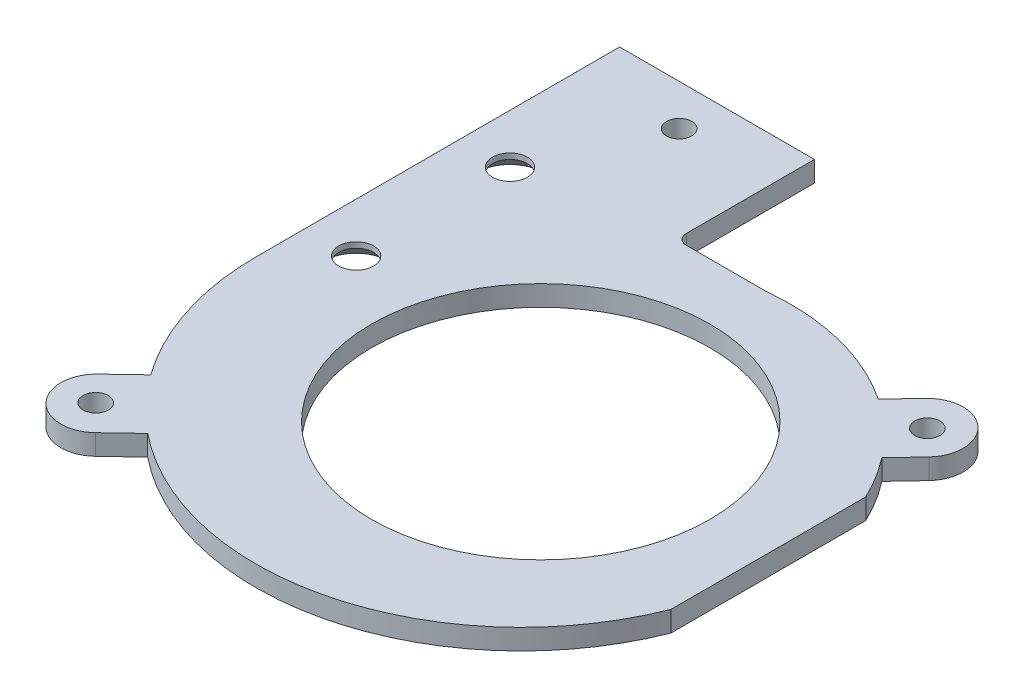
ISO-10303-21;
HEADER;
FILE_DESCRIPTION(('STEP AP214'),'2;1');
FILE_NAME('part.step','',(''),(''),'','','');
FILE_SCHEMA(('AUTOMOTIVE_DESIGN { 1 0 10303 214 1 1 1 1 }'));
ENDSEC;
DATA;
#1=APPLICATION_CONTEXT('core data for automotive mechanical design processes');
#2=APPLICATION_PROTOCOL_DEFINITION('international standard','automotive_design',2000,#1);
#3=PRODUCT_CONTEXT('',#1,'mechanical');
#4=PRODUCT('Part','Part','',(#3));
#5=PRODUCT_RELATED_PRODUCT_CATEGORY('part','',(#4));
#6=PRODUCT_DEFINITION_FORMATION('','',#4);
#7=PRODUCT_DEFINITION_CONTEXT('part definition',#1,'design');
#8=PRODUCT_DEFINITION('design','',#6,#7);
#9=PRODUCT_DEFINITION_SHAPE('','',#8);
#10=(LENGTH_UNIT() NAMED_UNIT(*) SI_UNIT(.MILLI.,.METRE.));
#11=(NAMED_UNIT(*) PLANE_ANGLE_UNIT() SI_UNIT($,.RADIAN.));
#12=(NAMED_UNIT(*) SI_UNIT($,.STERADIAN.) SOLID_ANGLE_UNIT());
#13=UNCERTAINTY_MEASURE_WITH_UNIT(LENGTH_MEASURE(1.E-05),#10,'distance_accuracy_value','');
#14=(GEOMETRIC_REPRESENTATION_CONTEXT(3) GLOBAL_UNCERTAINTY_ASSIGNED_CONTEXT((#13)) GLOBAL_UNIT_ASSIGNED_CONTEXT((#10,
#11,#12)) REPRESENTATION_CONTEXT('',''));
#15=CARTESIAN_POINT('',(0.,0.,0.));
#16=DIRECTION('',(0.,0.,1.));
#17=DIRECTION('',(1.,0.,0.));
#18=AXIS2_PLACEMENT_3D('',#15,#16,#17);
#19=CARTESIAN_POINT('',(8.978565370932,-34.81359238585,151.37999999223));
#20=DIRECTION('',(3.85373208206454E-09,0.999999999999881,4.88111568497342E-07));
#21=DIRECTION('',(0.,-4.88111568497342E-07,0.999999999999881));
#22=AXIS2_PLACEMENT_3D('',#19,#20,#21);
#23=CYLINDRICAL_SURFACE('',#22,1.);
#24=CARTESIAN_POINT('',(8.97856536322453,-36.8135923858537,151.379999016007));
#25=DIRECTION('',(3.85373208206454E-09,0.999999999999881,4.88111568497342E-07));
#26=DIRECTION('',(0.,-4.88111568497342E-07,0.999999999999881));
#27=AXIS2_PLACEMENT_3D('',#24,#25,#26);
#28=CIRCLE('',#27,1.);
#29=CARTESIAN_POINT('',(8.97856536758903,-36.8135928739677,152.379999016007));
#30=VERTEX_POINT('',#29);
#31=CARTESIAN_POINT('',(7.97856536322454,-36.8135923820001,151.379999504628));
#32=VERTEX_POINT('',#31);
#33=EDGE_CURVE('E139',#30,#32,#28,.F.);
#34=ORIENTED_EDGE('',*,*,#33,.T.);
#35=DIRECTION('',(3.853731832869E-09,1.,0.));
#36=VECTOR('',#35,1.);
#37=CARTESIAN_POINT('',(7.978565370932,-34.813592382,151.37999999274));
#38=LINE('',#37,#36);
#39=CARTESIAN_POINT('',(7.97856537093249,-34.8135923820047,151.379999992485));
#40=VERTEX_POINT('',#39);
#41=EDGE_CURVE('E137',#40,#32,#38,.F.);
#42=ORIENTED_EDGE('',*,*,#41,.F.);
#43=CARTESIAN_POINT('',(8.978565370932,-34.8135923858584,151.37999999223));
#44=DIRECTION('',(3.85373208206454E-09,0.999999999999881,4.88111568497342E-07));
#45=DIRECTION('',(0.,-4.88111568497342E-07,0.999999999999881));
#46=AXIS2_PLACEMENT_3D('',#43,#44,#45);
#47=CIRCLE('',#46,1.);
#48=CARTESIAN_POINT('',(8.978565370932,-34.81359287397,152.37999999024));
#49=VERTEX_POINT('',#48);
#50=EDGE_CURVE('E19',#49,#40,#47,.F.);
#51=ORIENTED_EDGE('',*,*,#50,.F.);
#52=DIRECTION('',(0.,-0.999999999999881,-4.88111568497342E-07));
#53=VECTOR('',#52,1.);
#54=CARTESIAN_POINT('',(8.978565371443,-34.81359287397,152.37999999223));
#55=LINE('',#54,#53);
#56=EDGE_CURVE('E205',#49,#30,#55,.T.);
#57=ORIENTED_EDGE('',*,*,#56,.T.);
#58=EDGE_LOOP('',(#34,#42,#51,#57));
#59=FACE_BOUND('',#58,.T.);
#60=ADVANCED_FACE('F16',(#59),#23,.F.);
#61=CARTESIAN_POINT('',(-6.21660882999991,-36.8135937916034,154.379999023768));
#62=DIRECTION('',(-3.85373305832955E-09,-0.999999999999881,-4.88111568368455E-07));
#63=DIRECTION('',(0.,4.88111568368455E-07,-0.999999999999881));
#64=AXIS2_PLACEMENT_3D('',#61,#62,#63);
#65=CONICAL_SURFACE('',#64,3.1499999999322,0.78539816340929);
#66=CARTESIAN_POINT('',(-6.21660882999991,-36.8135937916762,154.379999023768));
#67=DIRECTION('',(-3.85373305832955E-09,-0.999999999999881,-4.88111568368455E-07));
#68=DIRECTION('',(0.,4.88111568368455E-07,-0.999999999999881));
#69=AXIS2_PLACEMENT_3D('',#66,#67,#68);
#70=CIRCLE('',#69,3.15000000000509);
#71=CARTESIAN_POINT('',(-6.21660882999991,-36.8135922541248,151.229999023763));
#72=VERTEX_POINT('',#71);
#73=EDGE_CURVE('E135',#72,#72,#70,.T.);
#74=ORIENTED_EDGE('',*,*,#73,.T.);
#75=EDGE_LOOP('',(#74));
#76=FACE_BOUND('',#75,.T.);
#77=CARTESIAN_POINT('',(-6.21660882441209,-35.3635937916287,154.379999731532));
#78=DIRECTION('',(-3.85373208206454E-09,-0.999999999999881,-4.88111568497342E-07));
#79=DIRECTION('',(0.,4.88111568497342E-07,-0.999999999999881));
#80=AXIS2_PLACEMENT_3D('',#77,#78,#79);
#81=CIRCLE('',#80,1.7);
#82=CARTESIAN_POINT('',(-6.21660882441209,-35.363592961839,152.679999731532));
#83=VERTEX_POINT('',#82);
#84=EDGE_CURVE('E185',#83,#83,#81,.F.);
#85=ORIENTED_EDGE('',*,*,#84,.T.);
#86=EDGE_LOOP('',(#85));
#87=FACE_BOUND('',#86,.T.);
#88=ADVANCED_FACE('F231',(#76,#87),#65,.F.);
#89=CARTESIAN_POINT('',(-6.21660882234191,-36.8136011131494,169.379999023768));
#90=DIRECTION('',(-3.85373195697229E-09,-0.999999999999881,-4.88111568374805E-07));
#91=DIRECTION('',(0.,4.88111568374805E-07,-0.999999999999881));
#92=AXIS2_PLACEMENT_3D('',#89,#90,#91);
#93=CONICAL_SURFACE('',#92,3.14999999989122,0.78539816340929);
#94=CARTESIAN_POINT('',(-6.21660882234191,-36.8136011132064,169.379999023768));
#95=DIRECTION('',(-3.85373195697229E-09,-0.999999999999881,-4.88111568374805E-07));
#96=DIRECTION('',(0.,4.88111568374805E-07,-0.999999999999881));
#97=AXIS2_PLACEMENT_3D('',#94,#95,#96);
#98=CIRCLE('',#97,3.14999999994825);
#99=CARTESIAN_POINT('',(-6.21660882234191,-36.813599575655,166.22999902382));
#100=VERTEX_POINT('',#99);
#101=EDGE_CURVE('E225',#100,#100,#98,.T.);
#102=ORIENTED_EDGE('',*,*,#101,.T.);
#103=EDGE_LOOP('',(#102));
#104=FACE_BOUND('',#103,.T.);
#105=CARTESIAN_POINT('',(-6.21660881675409,-35.3636011133087,169.379999731522));
#106=DIRECTION('',(-3.85373208206454E-09,-0.999999999999881,-4.88111568497342E-07));
#107=DIRECTION('',(0.,4.88111568497342E-07,-0.999999999999881));
#108=AXIS2_PLACEMENT_3D('',#105,#106,#107);
#109=CIRCLE('',#108,1.7);
#110=CARTESIAN_POINT('',(-6.21660881675409,-35.363600283519,167.679999731522));
#111=VERTEX_POINT('',#110);
#112=EDGE_CURVE('E178',#111,#111,#109,.F.);
#113=ORIENTED_EDGE('',*,*,#112,.T.);
#114=EDGE_LOOP('',(#113));
#115=FACE_BOUND('',#114,.T.);
#116=ADVANCED_FACE('F237',(#104,#115),#93,.F.);
#117=CARTESIAN_POINT('',(38.983391185061,-36.81360836511,183.87999900069));
#118=DIRECTION('',(3.85373208206454E-09,0.999999999999881,4.88111568497342E-07));
#119=DIRECTION('',(0.,-4.88111568497342E-07,0.999999999999881));
#120=AXIS2_PLACEMENT_3D('',#117,#118,#119);
#121=PLANE('',#120);
#122=ORIENTED_EDGE('',*,*,#101,.F.);
#123=EDGE_LOOP('',(#122));
#124=FACE_BOUND('',#123,.T.);
#125=CARTESIAN_POINT('',(-1.216608835871,-36.8135881976199,142.87999902121));
#126=DIRECTION('',(-3.85373208206454E-09,-0.999999999999881,-4.88111568497342E-07));
#127=DIRECTION('',(0.,4.88111568497342E-07,-0.999999999999881));
#128=AXIS2_PLACEMENT_3D('',#125,#126,#127);
#129=CIRCLE('',#128,1.23);
#130=CARTESIAN_POINT('',(-1.216608835871,-36.8135875972427,141.64999902121));
#131=VERTEX_POINT('',#130);
#132=EDGE_CURVE('E175',#131,#131,#129,.F.);
#133=ORIENTED_EDGE('',*,*,#132,.T.);
#134=EDGE_LOOP('',(#133));
#135=FACE_BOUND('',#134,.T.);
#136=CARTESIAN_POINT('',(-6.516608809528,-36.8136133637499,194.47999902391));
#137=DIRECTION('',(-3.85373208206454E-09,-0.999999999999881,-4.88111568497342E-07));
#138=DIRECTION('',(0.,4.88111568497342E-07,-0.999999999999881));
#139=AXIS2_PLACEMENT_3D('',#136,#137,#138);
#140=CIRCLE('',#139,1.23);
#141=CARTESIAN_POINT('',(-6.516608809528,-36.8136127633727,193.24999902391));
#142=VERTEX_POINT('',#141);
#143=EDGE_CURVE('E179',#142,#142,#140,.F.);
#144=ORIENTED_EDGE('',*,*,#143,.T.);
#145=EDGE_LOOP('',(#144));
#146=FACE_BOUND('',#145,.T.);
#147=CARTESIAN_POINT('',(36.183391170868,-36.8135947848199,156.07999900212));
#148=DIRECTION('',(-3.85373208206454E-09,-0.999999999999881,-4.88111568497342E-07));
#149=DIRECTION('',(0.,4.88111568497342E-07,-0.999999999999881));
#150=AXIS2_PLACEMENT_3D('',#147,#148,#149);
#151=CIRCLE('',#150,1.23);
#152=CARTESIAN_POINT('',(36.183391170868,-36.8135941844427,154.84999900212));
#153=VERTEX_POINT('',#152);
#154=EDGE_CURVE('E182',#153,#153,#151,.F.);
#155=ORIENTED_EDGE('',*,*,#154,.T.);
#156=EDGE_LOOP('',(#155));
#157=FACE_BOUND('',#156,.T.);
#158=CARTESIAN_POINT('',(16.783391180211,-36.8136036424934,174.37999901202));
#159=DIRECTION('',(-3.85373208206454E-09,-0.999999999999881,-4.88111568497342E-07));
#160=DIRECTION('',(0.,4.88111568497342E-07,-0.999999999999881));
#161=AXIS2_PLACEMENT_3D('',#158,#159,#160);
#162=CIRCLE('',#161,16.5);
#163=CARTESIAN_POINT('',(16.783391180211,-36.8135955886525,157.879999012022));
#164=VERTEX_POINT('',#163);
#165=EDGE_CURVE('E186',#164,#164,#162,.F.);
#166=ORIENTED_EDGE('',*,*,#165,.T.);
#167=EDGE_LOOP('',(#166));
#168=FACE_BOUND('',#167,.T.);
#169=CARTESIAN_POINT('',(-6.41660881899946,-36.8136133641331,194.479999032877));
#170=DIRECTION('',(3.85373208206454E-09,0.999999999999881,4.88111568497342E-07));
#171=DIRECTION('',(0.,-4.88111568497342E-07,0.999999999999881));
#172=AXIS2_PLACEMENT_3D('',#169,#170,#171);
#173=CIRCLE('',#172,3.5);
#174=CARTESIAN_POINT('',(-8.82877273093449,-36.81361211697,191.943965661255));
#175=VERTEX_POINT('',#174);
#176=CARTESIAN_POINT('',(-4.00444513458413,-36.8136146112981,197.016032620899));
#177=VERTEX_POINT('',#176);
#178=EDGE_CURVE('E190',#175,#177,#173,.T.);
#179=ORIENTED_EDGE('',*,*,#178,.F.);
#180=DIRECTION('',(0.724580962032362,0.,-0.689189690477344));
#181=VECTOR('',#180,1.);
#182=CARTESIAN_POINT('',(-8.8287732096511,-36.81361211697,191.943966116587));
#183=LINE('',#182,#181);
#184=CARTESIAN_POINT('',(-6.19489892542695,-36.8136086974114,189.438740202829));
#185=VERTEX_POINT('',#184);
#186=EDGE_CURVE('E196',#175,#185,#183,.T.);
#187=ORIENTED_EDGE('',*,*,#186,.T.);
#188=CARTESIAN_POINT('',(14.8833911802105,-36.8136036351803,174.379999012987));
#189=DIRECTION('',(3.85373208206454E-09,0.999999999999881,4.88111568497342E-07));
#190=DIRECTION('',(0.,-4.88111568497342E-07,0.999999999999881));
#191=AXIS2_PLACEMENT_3D('',#188,#189,#190);
#192=CIRCLE('',#191,25.904825805243);
#193=CARTESIAN_POINT('',(-11.02143462503,-36.81360353535,174.379999026214));
#194=VERTEX_POINT('',#193);
#195=EDGE_CURVE('E193',#194,#185,#192,.T.);
#196=ORIENTED_EDGE('',*,*,#195,.F.);
#197=DIRECTION('',(-5.10530194019814E-10,4.88111549223218E-07,-0.999999999999881));
#198=VECTOR('',#197,1.);
#199=CARTESIAN_POINT('',(-11.0214346250275,-36.81360353535,174.37999902622));
#200=LINE('',#199,#198);
#201=CARTESIAN_POINT('',(-11.0214346431513,-36.81358620739,138.879999026219));
#202=VERTEX_POINT('',#201);
#203=EDGE_CURVE('E199',#194,#202,#200,.T.);
#204=ORIENTED_EDGE('',*,*,#203,.T.);
#205=DIRECTION('',(1.,0.,-5.10530155490978E-10));
#206=VECTOR('',#205,1.);
#207=CARTESIAN_POINT('',(-11.02143463544,-36.81358620739,138.879999026217));
#208=LINE('',#207,#206);
#209=CARTESIAN_POINT('',(7.97856535684291,-36.8135862439976,138.879999016519));
#210=VERTEX_POINT('',#209);
#211=EDGE_CURVE('E200',#202,#210,#208,.T.);
#212=ORIENTED_EDGE('',*,*,#211,.T.);
#213=DIRECTION('',(-5.1053015549115E-10,4.88111568499309E-07,-0.999999999999881));
#214=VECTOR('',#213,1.);
#215=CARTESIAN_POINT('',(7.97856537981676,-36.8136082456257,183.879999016519));
#216=LINE('',#215,#214);
#217=EDGE_CURVE('E143',#32,#210,#216,.T.);
#218=ORIENTED_EDGE('',*,*,#217,.F.);
#219=ORIENTED_EDGE('',*,*,#33,.F.);
#220=DIRECTION('',(1.,0.,-5.10530155490978E-10));
#221=VECTOR('',#220,1.);
#222=CARTESIAN_POINT('',(8.978565371443,-36.81359287397,152.379999016007));
#223=LINE('',#222,#221);
#224=CARTESIAN_POINT('',(16.7833911689793,-36.813592889007,152.379999012025));
#225=VERTEX_POINT('',#224);
#226=EDGE_CURVE('E369',#30,#225,#223,.T.);
#227=ORIENTED_EDGE('',*,*,#226,.T.);
#228=CARTESIAN_POINT('',(19.0151479369675,-36.8136036510992,174.379999010887));
#229=DIRECTION('',(3.85373208206454E-09,0.999999999999881,4.88111568497342E-07));
#230=DIRECTION('',(0.,-4.88111568497342E-07,0.999999999999881));
#231=AXIS2_PLACEMENT_3D('',#228,#229,#230);
#232=CIRCLE('',#231,22.112908859337);
#233=CARTESIAN_POINT('',(31.3343527833157,-36.8135981961535,156.01650451297));
#234=VERTEX_POINT('',#233);
#235=EDGE_CURVE('E202',#234,#225,#232,.T.);
#236=ORIENTED_EDGE('',*,*,#235,.F.);
#237=DIRECTION('',(0.685818352556089,0.,-0.727772758007094));
#238=VECTOR('',#237,1.);
#239=CARTESIAN_POINT('',(31.3343522996923,-36.81359473514,156.01650502618));
#240=LINE('',#239,#238);
#241=CARTESIAN_POINT('',(33.5833911632443,-36.8135941570032,153.629882955639));
#242=VERTEX_POINT('',#241);
#243=EDGE_CURVE('E210',#234,#242,#240,.T.);
#244=ORIENTED_EDGE('',*,*,#243,.T.);
#245=CARTESIAN_POINT('',(36.1305958098985,-36.8135947603282,156.030247196347));
#246=DIRECTION('',(3.85373208206454E-09,0.999999999999881,4.88111568497342E-07));
#247=DIRECTION('',(0.,-4.88111568497342E-07,0.999999999999881));
#248=AXIS2_PLACEMENT_3D('',#245,#246,#247);
#249=CIRCLE('',#248,3.5);
#250=CARTESIAN_POINT('',(38.6778004692925,-36.813596512665,158.430611423532));
#251=VERTEX_POINT('',#250);
#252=EDGE_CURVE('E207',#251,#242,#249,.T.);
#253=ORIENTED_EDGE('',*,*,#252,.F.);
#254=DIRECTION('',(0.685818352556089,0.,-0.727772758007094));
#255=VECTOR('',#254,1.);
#256=CARTESIAN_POINT('',(36.4570024765123,-36.81359708354,160.78726500995));
#257=LINE('',#256,#255);
#258=CARTESIAN_POINT('',(36.4570027458092,-36.8136005510887,160.787264731924));
#259=VERTEX_POINT('',#258);
#260=EDGE_CURVE('E377',#259,#251,#257,.T.);
#261=ORIENTED_EDGE('',*,*,#260,.F.);
#262=CARTESIAN_POINT('',(19.0151479369675,-36.8136036510977,174.379999010887));
#263=DIRECTION('',(3.85373208206454E-09,0.999999999999881,4.88111568497342E-07));
#264=DIRECTION('',(0.,-4.88111568497342E-07,0.999999999999881));
#265=AXIS2_PLACEMENT_3D('',#262,#263,#264);
#266=CIRCLE('',#265,22.112908859337);
#267=CARTESIAN_POINT('',(38.9833911753594,-36.81359909099,164.87999900069));
#268=VERTEX_POINT('',#267);
#269=EDGE_CURVE('E212',#268,#259,#266,.T.);
#270=ORIENTED_EDGE('',*,*,#269,.F.);
#271=DIRECTION('',(-5.1053015549115E-10,4.88111568499309E-07,-0.999999999999881));
#272=VECTOR('',#271,1.);
#273=CARTESIAN_POINT('',(38.9833911850605,-36.81360836511,183.87999900069));
#274=LINE('',#273,#272);
#275=CARTESIAN_POINT('',(38.9833911850605,-36.8136083651101,183.879999488796));
#276=VERTEX_POINT('',#275);
#277=EDGE_CURVE('E218',#276,#268,#274,.T.);
#278=ORIENTED_EDGE('',*,*,#277,.F.);
#279=CARTESIAN_POINT('',(14.8833911802105,-36.8136036351748,174.379999012987));
#280=DIRECTION('',(3.85373208206454E-09,0.999999999999881,4.88111568497342E-07));
#281=DIRECTION('',(0.,-4.88111568497342E-07,0.999999999999881));
#282=AXIS2_PLACEMENT_3D('',#279,#280,#281);
#283=CIRCLE('',#282,25.904825805243);
#284=CARTESIAN_POINT('',(-1.39342729166376,-36.8136111917382,194.5325467535));
#285=VERTEX_POINT('',#284);
#286=EDGE_CURVE('E223',#285,#276,#283,.T.);
#287=ORIENTED_EDGE('',*,*,#286,.F.);
#288=DIRECTION('',(0.724580962032362,0.,-0.689189690477344));
#289=VECTOR('',#288,1.);
#290=CARTESIAN_POINT('',(-4.0044453763111,-36.8136146113,197.016032850817));
#291=LINE('',#290,#289);
#292=EDGE_CURVE('E349',#177,#285,#291,.T.);
#293=ORIENTED_EDGE('',*,*,#292,.F.);
#294=EDGE_LOOP('',(#179,#187,#196,#204,#212,#218,#219,#227,#236,#244,#253,#261,#270,#278,#287,#293));
#295=FACE_BOUND('',#294,.T.);
#296=ORIENTED_EDGE('',*,*,#73,.F.);
#297=EDGE_LOOP('',(#296));
#298=FACE_BOUND('',#297,.T.);
#299=ADVANCED_FACE('F234',(#124,#135,#146,#157,#168,#295,#298),#121,.F.);
#300=CARTESIAN_POINT('',(14.883391187918,-34.81360363518,174.37999998921));
#301=DIRECTION('',(3.85373208206454E-09,0.999999999999881,4.88111568497342E-07));
#302=DIRECTION('',(0.,-4.88111568497342E-07,0.999999999999881));
#303=AXIS2_PLACEMENT_3D('',#300,#301,#302);
#304=CYLINDRICAL_SURFACE('',#303,25.904825805243);
#305=ORIENTED_EDGE('',*,*,#286,.T.);
#306=DIRECTION('',(3.853731832869E-09,1.,0.));
#307=VECTOR('',#306,1.);
#308=CARTESIAN_POINT('',(38.983391192768,-34.81360836511,183.87999997691));
#309=LINE('',#308,#307);
#310=CARTESIAN_POINT('',(38.983391192768,-34.81360836511,183.879999976907));
#311=VERTEX_POINT('',#310);
#312=EDGE_CURVE('E220',#311,#276,#309,.F.);
#313=ORIENTED_EDGE('',*,*,#312,.F.);
#314=CARTESIAN_POINT('',(14.883391187918,-34.8136036351752,174.37999998921));
#315=DIRECTION('',(3.85373208206454E-09,0.999999999999881,4.88111568497342E-07));
#316=DIRECTION('',(0.,-4.88111568497342E-07,0.999999999999881));
#317=AXIS2_PLACEMENT_3D('',#314,#315,#316);
#318=CIRCLE('',#317,25.904825805243);
#319=CARTESIAN_POINT('',(-1.39342704223063,-34.8136134091402,194.532547499801));
#320=VERTEX_POINT('',#319);
#321=EDGE_CURVE('E172',#320,#311,#318,.T.);
#322=ORIENTED_EDGE('',*,*,#321,.F.);
#323=DIRECTION('',(2.45580549129599E-07,0.999999999999937,2.58191602404143E-07));
#324=VECTOR('',#323,1.);
#325=CARTESIAN_POINT('',(-1.39342680050402,-34.8136146113,194.532547269883));
#326=LINE('',#325,#324);
#327=EDGE_CURVE('E189',#285,#320,#326,.T.);
#328=ORIENTED_EDGE('',*,*,#327,.F.);
#329=EDGE_LOOP('',(#305,#313,#322,#328));
#330=FACE_BOUND('',#329,.T.);
#331=ADVANCED_FACE('F236',(#330),#304,.T.);
#332=CARTESIAN_POINT('',(38.983391192768,-34.81360836511,183.87999997691));
#333=DIRECTION('',(1.,-3.853731832869E-09,-5.105320365423E-10));
#334=DIRECTION('',(3.853731832869E-09,1.,0.));
#335=AXIS2_PLACEMENT_3D('',#332,#333,#334);
#336=PLANE('',#335);
#337=DIRECTION('',(3.85373208206454E-09,0.999999999999881,4.88111568497342E-07));
#338=VECTOR('',#337,1.);
#339=CARTESIAN_POINT('',(38.9833911830659,-34.8135990909924,164.879999976911));
#340=LINE('',#339,#338);
#341=CARTESIAN_POINT('',(38.9833911879169,-34.8135990909871,164.879999987108));
#342=VERTEX_POINT('',#341);
#343=EDGE_CURVE('E215',#342,#268,#340,.F.);
#344=ORIENTED_EDGE('',*,*,#343,.F.);
#345=DIRECTION('',(0.,-4.88111568497342E-07,0.999999999999881));
#346=VECTOR('',#345,1.);
#347=CARTESIAN_POINT('',(38.983391192768,-34.81360836511,183.87999997691));
#348=LINE('',#347,#346);
#349=EDGE_CURVE('E169',#311,#342,#348,.F.);
#350=ORIENTED_EDGE('',*,*,#349,.F.);
#351=ORIENTED_EDGE('',*,*,#312,.T.);
#352=ORIENTED_EDGE('',*,*,#277,.T.);
#353=EDGE_LOOP('',(#344,#350,#351,#352));
#354=FACE_BOUND('',#353,.T.);
#355=ADVANCED_FACE('F245',(#354),#336,.T.);
#356=CARTESIAN_POINT('',(19.015147944675,-34.8136036511,174.37999998711));
#357=DIRECTION('',(3.85373208206454E-09,0.999999999999881,4.88111568497342E-07));
#358=DIRECTION('',(0.,-4.88111568497342E-07,0.999999999999881));
#359=AXIS2_PLACEMENT_3D('',#356,#357,#358);
#360=CYLINDRICAL_SURFACE('',#359,22.112908859337);
#361=ORIENTED_EDGE('',*,*,#269,.T.);
#362=DIRECTION('',(2.45667345536751E-07,0.999999999999943,2.31505194910304E-07));
#363=VECTOR('',#362,1.);
#364=CARTESIAN_POINT('',(36.4570029678465,-34.81359708354,160.787265472961));
#365=LINE('',#364,#363);
#366=CARTESIAN_POINT('',(36.4570029678447,-34.8135970835416,160.787265472962));
#367=VERTEX_POINT('',#366);
#368=EDGE_CURVE('E214',#367,#259,#365,.F.);
#369=ORIENTED_EDGE('',*,*,#368,.F.);
#370=CARTESIAN_POINT('',(19.015147944675,-34.8136036510947,174.37999998711));
#371=DIRECTION('',(3.85373208206454E-09,0.999999999999881,4.88111568497342E-07));
#372=DIRECTION('',(0.,-4.88111568497342E-07,0.999999999999881));
#373=AXIS2_PLACEMENT_3D('',#370,#371,#372);
#374=CIRCLE('',#373,22.112908859337);
#375=EDGE_CURVE('E166',#342,#367,#374,.T.);
#376=ORIENTED_EDGE('',*,*,#375,.F.);
#377=ORIENTED_EDGE('',*,*,#343,.T.);
#378=EDGE_LOOP('',(#361,#369,#376,#377));
#379=FACE_BOUND('',#378,.T.);
#380=ADVANCED_FACE('F327',(#379),#360,.T.);
#381=CARTESIAN_POINT('',(36.457002967847,-34.81359708354,160.78726547296));
#382=DIRECTION('',(0.727772758007053,-3.37560512995124E-07,0.68581835255605));
#383=DIRECTION('',(0.685818352556089,0.,-0.727772758007094));
#384=AXIS2_PLACEMENT_3D('',#381,#382,#383);
#385=PLANE('',#384);
#386=DIRECTION('',(3.85373208206454E-09,0.999999999999881,4.88111568497342E-07));
#387=VECTOR('',#386,1.);
#388=CARTESIAN_POINT('',(38.6778004833707,-34.8135959417918,158.430612392997));
#389=LINE('',#388,#387);
#390=CARTESIAN_POINT('',(38.677800477,-34.8135959417936,158.430612399761));
#391=VERTEX_POINT('',#390);
#392=EDGE_CURVE('E211',#391,#251,#389,.F.);
#393=ORIENTED_EDGE('',*,*,#392,.F.);
#394=DIRECTION('',(0.685818352557551,3.52591341394358E-07,-0.72777275800563));
#395=VECTOR('',#394,1.);
#396=CARTESIAN_POINT('',(36.457002967846,-34.8135970835431,160.78726547296));
#397=LINE('',#396,#395);
#398=EDGE_CURVE('E165',#367,#391,#397,.T.);
#399=ORIENTED_EDGE('',*,*,#398,.F.);
#400=ORIENTED_EDGE('',*,*,#368,.T.);
#401=ORIENTED_EDGE('',*,*,#260,.T.);
#402=EDGE_LOOP('',(#393,#399,#400,#401));
#403=FACE_BOUND('',#402,.T.);
#404=ADVANCED_FACE('F323',(#403),#385,.T.);
#405=CARTESIAN_POINT('',(36.130595817606,-34.81359476033,156.03024817257));
#406=DIRECTION('',(3.85373208206454E-09,0.999999999999881,4.88111568497342E-07));
#407=DIRECTION('',(0.,-4.88111568497342E-07,0.999999999999881));
#408=AXIS2_PLACEMENT_3D('',#405,#406,#407);
#409=CYLINDRICAL_SURFACE('',#408,3.5);
#410=ORIENTED_EDGE('',*,*,#252,.T.);
#411=DIRECTION('',(2.45667345536751E-07,0.999999999999943,2.31505194910304E-07));
#412=VECTOR('',#411,1.);
#413=CARTESIAN_POINT('',(33.5833916609498,-34.81359473514,153.629883411889));
#414=LINE('',#413,#412);
#415=CARTESIAN_POINT('',(33.5833914127651,-34.813593578869,153.629883675256));
#416=VERTEX_POINT('',#415);
#417=EDGE_CURVE('E373',#242,#416,#414,.T.);
#418=ORIENTED_EDGE('',*,*,#417,.T.);
#419=CARTESIAN_POINT('',(36.130595817606,-34.8135947603318,156.03024817257));
#420=DIRECTION('',(3.85373208206454E-09,0.999999999999881,4.88111568497342E-07));
#421=DIRECTION('',(0.,-4.88111568497342E-07,0.999999999999881));
#422=AXIS2_PLACEMENT_3D('',#419,#420,#421);
#423=CIRCLE('',#422,3.5);
#424=EDGE_CURVE('E162',#391,#416,#423,.T.);
#425=ORIENTED_EDGE('',*,*,#424,.F.);
#426=ORIENTED_EDGE('',*,*,#392,.T.);
#427=EDGE_LOOP('',(#410,#418,#425,#426));
#428=FACE_BOUND('',#427,.T.);
#429=ADVANCED_FACE('F319',(#428),#409,.T.);
#430=CARTESIAN_POINT('',(31.334352791027,-34.81359473514,156.01650548919));
#431=DIRECTION('',(0.727772758007053,-3.37560512995124E-07,0.68581835255605));
#432=DIRECTION('',(0.685818352556089,0.,-0.727772758007094));
#433=AXIS2_PLACEMENT_3D('',#430,#431,#432);
#434=PLANE('',#433);
#435=ORIENTED_EDGE('',*,*,#417,.F.);
#436=ORIENTED_EDGE('',*,*,#243,.F.);
#437=DIRECTION('',(3.85373208206454E-09,0.999999999999881,4.88111568497342E-07));
#438=VECTOR('',#437,1.);
#439=CARTESIAN_POINT('',(31.3343527910238,-34.8135947351408,156.016505489195));
#440=LINE('',#439,#438);
#441=CARTESIAN_POINT('',(31.3343527910232,-34.8135947351373,156.016505489194));
#442=VERTEX_POINT('',#441);
#443=EDGE_CURVE('E206',#442,#234,#440,.F.);
#444=ORIENTED_EDGE('',*,*,#443,.F.);
#445=DIRECTION('',(-0.685818352556077,-3.52591342884234E-07,0.72777275800702));
#446=VECTOR('',#445,1.);
#447=CARTESIAN_POINT('',(33.583391177324,-34.8135935788683,153.6298839251));
#448=LINE('',#447,#446);
#449=EDGE_CURVE('E161',#416,#442,#448,.T.);
#450=ORIENTED_EDGE('',*,*,#449,.F.);
#451=EDGE_LOOP('',(#435,#436,#444,#450));
#452=FACE_BOUND('',#451,.T.);
#453=ADVANCED_FACE('F315',(#452),#434,.F.);
#454=CARTESIAN_POINT('',(19.015147944675,-34.8136036511,174.37999998711));
#455=DIRECTION('',(3.85373208206454E-09,0.999999999999881,4.88111568497342E-07));
#456=DIRECTION('',(0.,-4.88111568497342E-07,0.999999999999881));
#457=AXIS2_PLACEMENT_3D('',#454,#455,#456);
#458=CYLINDRICAL_SURFACE('',#457,22.112908859337);
#459=ORIENTED_EDGE('',*,*,#235,.T.);
#460=DIRECTION('',(0.,-0.999999999999881,-4.88111568497342E-07));
#461=VECTOR('',#460,1.);
#462=CARTESIAN_POINT('',(16.783391168979,-34.81359287397,152.379999988245));
#463=LINE('',#462,#461);
#464=CARTESIAN_POINT('',(16.7833911728411,-34.8135929040414,152.379999988249));
#465=VERTEX_POINT('',#464);
#466=EDGE_CURVE('E144',#225,#465,#463,.F.);
#467=ORIENTED_EDGE('',*,*,#466,.T.);
#468=CARTESIAN_POINT('',(19.015147944675,-34.8136036510951,174.37999998711));
#469=DIRECTION('',(3.85373208206454E-09,0.999999999999881,4.88111568497342E-07));
#470=DIRECTION('',(0.,-4.88111568497342E-07,0.999999999999881));
#471=AXIS2_PLACEMENT_3D('',#468,#469,#470);
#472=CIRCLE('',#471,22.112908859337);
#473=EDGE_CURVE('E154',#442,#465,#472,.T.);
#474=ORIENTED_EDGE('',*,*,#473,.F.);
#475=ORIENTED_EDGE('',*,*,#443,.T.);
#476=EDGE_LOOP('',(#459,#467,#474,#475));
#477=FACE_BOUND('',#476,.T.);
#478=ADVANCED_FACE('F311',(#477),#458,.T.);
#479=CARTESIAN_POINT('',(8.978565371443,-34.81359287397,152.37999999223));
#480=DIRECTION('',(5.10530155491039E-10,-4.88111568497342E-07,0.999999999999881));
#481=DIRECTION('',(0.,-0.999999999999881,-4.88111568497342E-07));
#482=AXIS2_PLACEMENT_3D('',#479,#480,#481);
#483=PLANE('',#482);
#484=ORIENTED_EDGE('',*,*,#466,.F.);
#485=ORIENTED_EDGE('',*,*,#226,.F.);
#486=ORIENTED_EDGE('',*,*,#56,.F.);
#487=DIRECTION('',(1.,-3.85373208206408E-09,0.));
#488=VECTOR('',#487,1.);
#489=CARTESIAN_POINT('',(38.983391192768,-34.8135929895956,152.37999998825));
#490=LINE('',#489,#488);
#491=EDGE_CURVE('E134',#465,#49,#490,.F.);
#492=ORIENTED_EDGE('',*,*,#491,.F.);
#493=EDGE_LOOP('',(#484,#485,#486,#492));
#494=FACE_BOUND('',#493,.T.);
#495=ADVANCED_FACE('F308',(#494),#483,.F.);
#496=CARTESIAN_POINT('',(7.978565370932,-34.813592382,151.37999999274));
#497=DIRECTION('',(1.,-3.853731832869E-09,-5.105320365423E-10));
#498=DIRECTION('',(3.853731832869E-09,1.,0.));
#499=AXIS2_PLACEMENT_3D('',#496,#497,#498);
#500=PLANE('',#499);
#501=DIRECTION('',(3.853731832869E-09,1.,0.));
#502=VECTOR('',#501,1.);
#503=CARTESIAN_POINT('',(7.97856536455035,-34.813592382,138.87999901652));
#504=LINE('',#503,#502);
#505=CARTESIAN_POINT('',(7.97856536933732,-34.8135862806049,138.87999950463));
#506=VERTEX_POINT('',#505);
#507=EDGE_CURVE('E148',#210,#506,#504,.T.);
#508=ORIENTED_EDGE('',*,*,#507,.T.);
#509=DIRECTION('',(0.,-4.88111568497342E-07,0.999999999999881));
#510=VECTOR('',#509,1.);
#511=CARTESIAN_POINT('',(7.97856537093297,-34.8136082456257,183.87999997691));
#512=LINE('',#511,#510);
#513=EDGE_CURVE('E131',#40,#506,#512,.F.);
#514=ORIENTED_EDGE('',*,*,#513,.F.);
#515=ORIENTED_EDGE('',*,*,#41,.T.);
#516=ORIENTED_EDGE('',*,*,#217,.T.);
#517=EDGE_LOOP('',(#508,#514,#515,#516));
#518=FACE_BOUND('',#517,.T.);
#519=ADVANCED_FACE('F146',(#518),#500,.T.);
#520=CARTESIAN_POINT('',(-11.02143463544,-34.81358620739,138.88000000244));
#521=DIRECTION('',(5.10530155491039E-10,-4.88111568497342E-07,0.999999999999881));
#522=DIRECTION('',(0.,-0.999999999999881,-4.88111568497342E-07));
#523=AXIS2_PLACEMENT_3D('',#520,#521,#522);
#524=PLANE('',#523);
#525=ORIENTED_EDGE('',*,*,#507,.F.);
#526=ORIENTED_EDGE('',*,*,#211,.F.);
#527=DIRECTION('',(3.853731832869E-09,1.,0.));
#528=VECTOR('',#527,1.);
#529=CARTESIAN_POINT('',(-11.0214346354439,-34.81360353535,138.87999902622));
#530=LINE('',#529,#528);
#531=CARTESIAN_POINT('',(-11.0214346354413,-34.8135862073842,138.879999670567));
#532=VERTEX_POINT('',#531);
#533=EDGE_CURVE('E361',#202,#532,#530,.T.);
#534=ORIENTED_EDGE('',*,*,#533,.T.);
#535=DIRECTION('',(1.,-3.85373208206408E-09,0.));
#536=VECTOR('',#535,1.);
#537=CARTESIAN_POINT('',(38.983391192768,-34.8135864000894,138.87999999274));
#538=LINE('',#537,#536);
#539=EDGE_CURVE('E150',#506,#532,#538,.F.);
#540=ORIENTED_EDGE('',*,*,#539,.F.);
#541=EDGE_LOOP('',(#525,#526,#534,#540));
#542=FACE_BOUND('',#541,.T.);
#543=ADVANCED_FACE('F301',(#542),#524,.F.);
#544=CARTESIAN_POINT('',(-11.02143461732,-34.81360353535,174.38000000244));
#545=DIRECTION('',(1.,-3.853731832869E-09,-5.105320365423E-10));
#546=DIRECTION('',(3.853731832869E-09,1.,0.));
#547=AXIS2_PLACEMENT_3D('',#544,#545,#546);
#548=PLANE('',#547);
#549=ORIENTED_EDGE('',*,*,#533,.F.);
#550=ORIENTED_EDGE('',*,*,#203,.F.);
#551=DIRECTION('',(3.85373208206454E-09,0.999999999999881,4.88111568497342E-07));
#552=VECTOR('',#551,1.);
#553=CARTESIAN_POINT('',(-11.021434617325,-34.8136035353497,174.38000000244));
#554=LINE('',#553,#552);
#555=CARTESIAN_POINT('',(-11.0214346263825,-34.8136035353441,174.379999995825));
#556=VERTEX_POINT('',#555);
#557=EDGE_CURVE('E197',#556,#194,#554,.F.);
#558=ORIENTED_EDGE('',*,*,#557,.F.);
#559=DIRECTION('',(0.,-4.88111568497342E-07,0.999999999999881));
#560=VECTOR('',#559,1.);
#561=CARTESIAN_POINT('',(-11.02143463544,-34.8136081724048,183.87999997691));
#562=LINE('',#561,#560);
#563=EDGE_CURVE('E152',#532,#556,#562,.T.);
#564=ORIENTED_EDGE('',*,*,#563,.F.);
#565=EDGE_LOOP('',(#549,#550,#558,#564));
#566=FACE_BOUND('',#565,.T.);
#567=ADVANCED_FACE('F297',(#566),#548,.F.);
#568=CARTESIAN_POINT('',(14.883391187918,-34.81360363518,174.37999998921));
#569=DIRECTION('',(3.85373208206454E-09,0.999999999999881,4.88111568497342E-07));
#570=DIRECTION('',(0.,-4.88111568497342E-07,0.999999999999881));
#571=AXIS2_PLACEMENT_3D('',#568,#569,#570);
#572=CYLINDRICAL_SURFACE('',#571,25.904825805243);
#573=ORIENTED_EDGE('',*,*,#195,.T.);
#574=DIRECTION('',(2.45580549129599E-07,0.999999999999937,2.58191602404143E-07));
#575=VECTOR('',#574,1.);
#576=CARTESIAN_POINT('',(-6.19489843426751,-34.81361211697,189.438740719212));
#577=LINE('',#576,#575);
#578=CARTESIAN_POINT('',(-6.19489867599278,-34.8136109042903,189.438740949131));
#579=VERTEX_POINT('',#578);
#580=EDGE_CURVE('E357',#185,#579,#577,.T.);
#581=ORIENTED_EDGE('',*,*,#580,.T.);
#582=CARTESIAN_POINT('',(14.883391187918,-34.8136036351743,174.37999998921));
#583=DIRECTION('',(3.85373208206454E-09,0.999999999999881,4.88111568497342E-07));
#584=DIRECTION('',(0.,-4.88111568497342E-07,0.999999999999881));
#585=AXIS2_PLACEMENT_3D('',#582,#583,#584);
#586=CIRCLE('',#585,25.904825805243);
#587=EDGE_CURVE('E158',#556,#579,#586,.T.);
#588=ORIENTED_EDGE('',*,*,#587,.F.);
#589=ORIENTED_EDGE('',*,*,#557,.T.);
#590=EDGE_LOOP('',(#573,#581,#588,#589));
#591=FACE_BOUND('',#590,.T.);
#592=ADVANCED_FACE('F293',(#591),#572,.T.);
#593=CARTESIAN_POINT('',(-8.82877271849,-34.81361211697,191.94396663297));
#594=DIRECTION('',(0.6891896904773,-3.56332302300555E-07,0.724580962032316));
#595=DIRECTION('',(0.724580962032362,0.,-0.689189690477344));
#596=AXIS2_PLACEMENT_3D('',#593,#594,#595);
#597=PLANE('',#596);
#598=ORIENTED_EDGE('',*,*,#580,.F.);
#599=ORIENTED_EDGE('',*,*,#186,.F.);
#600=DIRECTION('',(3.85373208206454E-09,0.999999999999881,4.88111568497342E-07));
#601=VECTOR('',#600,1.);
#602=CARTESIAN_POINT('',(-8.82877271848649,-34.8136121169669,191.943966632974));
#603=LINE('',#602,#601);
#604=CARTESIAN_POINT('',(-8.82877272322716,-34.813612116972,191.943966637478));
#605=VERTEX_POINT('',#604);
#606=EDGE_CURVE('E192',#605,#175,#603,.F.);
#607=ORIENTED_EDGE('',*,*,#606,.F.);
#608=DIRECTION('',(-0.724580962032403,-3.3360912035004E-07,0.689189690477219));
#609=VECTOR('',#608,1.);
#610=CARTESIAN_POINT('',(-6.19489891771902,-34.8136109042909,189.43874117905));
#611=LINE('',#610,#609);
#612=EDGE_CURVE('E404',#579,#605,#611,.T.);
#613=ORIENTED_EDGE('',*,*,#612,.F.);
#614=EDGE_LOOP('',(#598,#599,#607,#613));
#615=FACE_BOUND('',#614,.T.);
#616=ADVANCED_FACE('F290',(#615),#597,.F.);
#617=CARTESIAN_POINT('',(-6.416608811292,-34.81361336413,194.4800000091));
#618=DIRECTION('',(3.85373208206454E-09,0.999999999999881,4.88111568497342E-07));
#619=DIRECTION('',(0.,-4.88111568497342E-07,0.999999999999881));
#620=AXIS2_PLACEMENT_3D('',#617,#618,#619);
#621=CYLINDRICAL_SURFACE('',#620,3.5);
#622=ORIENTED_EDGE('',*,*,#178,.T.);
#623=DIRECTION('',(2.45580549129599E-07,0.999999999999937,2.58191602404143E-07));
#624=VECTOR('',#623,1.);
#625=CARTESIAN_POINT('',(-4.00444488515,-34.8136146113,197.0160333672));
#626=LINE('',#625,#624);
#627=CARTESIAN_POINT('',(-4.00444488988605,-34.8136146113,197.016033371705));
#628=VERTEX_POINT('',#627);
#629=EDGE_CURVE('E34',#628,#177,#626,.F.);
#630=ORIENTED_EDGE('',*,*,#629,.F.);
#631=CARTESIAN_POINT('',(-6.416608811292,-34.8136133641369,194.4800000091));
#632=DIRECTION('',(3.85373208206454E-09,0.999999999999881,4.88111568497342E-07));
#633=DIRECTION('',(0.,-4.88111568497342E-07,0.999999999999881));
#634=AXIS2_PLACEMENT_3D('',#631,#632,#633);
#635=CIRCLE('',#634,3.5);
#636=EDGE_CURVE('E403',#605,#628,#635,.T.);
#637=ORIENTED_EDGE('',*,*,#636,.F.);
#638=ORIENTED_EDGE('',*,*,#606,.T.);
#639=EDGE_LOOP('',(#622,#630,#637,#638));
#640=FACE_BOUND('',#639,.T.);
#641=ADVANCED_FACE('F286',(#640),#621,.T.);
#642=CARTESIAN_POINT('',(-4.00444488515,-34.8136146113,197.0160333672));
#643=DIRECTION('',(0.6891896904773,-3.56332302300555E-07,0.724580962032316));
#644=DIRECTION('',(0.724580962032362,0.,-0.689189690477344));
#645=AXIS2_PLACEMENT_3D('',#642,#643,#644);
#646=PLANE('',#645);
#647=ORIENTED_EDGE('',*,*,#327,.T.);
#648=DIRECTION('',(0.724580962031996,3.33609120463093E-07,-0.689189690477648));
#649=VECTOR('',#648,1.);
#650=CARTESIAN_POINT('',(-4.00444488515002,-34.8136146112963,197.0160333672));
#651=LINE('',#650,#649);
#652=EDGE_CURVE('E344',#628,#320,#651,.T.);
#653=ORIENTED_EDGE('',*,*,#652,.F.);
#654=ORIENTED_EDGE('',*,*,#629,.T.);
#655=ORIENTED_EDGE('',*,*,#292,.T.);
#656=EDGE_LOOP('',(#647,#653,#654,#655));
#657=FACE_BOUND('',#656,.T.);
#658=ADVANCED_FACE('F282',(#657),#646,.T.);
#659=CARTESIAN_POINT('',(16.783391180211,-36.8136036425,174.37999901202));
#660=DIRECTION('',(-3.85373208206454E-09,-0.999999999999881,-4.88111568497342E-07));
#661=DIRECTION('',(0.,4.88111568497342E-07,-0.999999999999881));
#662=AXIS2_PLACEMENT_3D('',#659,#660,#661);
#663=CYLINDRICAL_SURFACE('',#662,16.5);
#664=CARTESIAN_POINT('',(16.7833911879185,-34.8136036425034,174.379999988243));
#665=DIRECTION('',(-3.85373208206454E-09,-0.999999999999881,-4.88111568497342E-07));
#666=DIRECTION('',(0.,4.88111568497342E-07,-0.999999999999881));
#667=AXIS2_PLACEMENT_3D('',#664,#665,#666);
#668=CIRCLE('',#667,16.5);
#669=CARTESIAN_POINT('',(16.7833911879185,-34.8135955886625,157.879999988245));
#670=VERTEX_POINT('',#669);
#671=EDGE_CURVE('E401',#670,#670,#668,.T.);
#672=ORIENTED_EDGE('',*,*,#671,.F.);
#673=EDGE_LOOP('',(#672));
#674=FACE_BOUND('',#673,.T.);
#675=ORIENTED_EDGE('',*,*,#165,.F.);
#676=EDGE_LOOP('',(#675));
#677=FACE_BOUND('',#676,.T.);
#678=ADVANCED_FACE('F278',(#674,#677),#663,.F.);
#679=CARTESIAN_POINT('',(-6.21660883,-36.81359379163,154.37999902377));
#680=DIRECTION('',(-3.85373208206454E-09,-0.999999999999881,-4.88111568497342E-07));
#681=DIRECTION('',(0.,4.88111568497342E-07,-0.999999999999881));
#682=AXIS2_PLACEMENT_3D('',#679,#680,#681);
#683=CYLINDRICAL_SURFACE('',#682,1.7);
#684=ORIENTED_EDGE('',*,*,#84,.F.);
#685=EDGE_LOOP('',(#684));
#686=FACE_BOUND('',#685,.T.);
#687=CARTESIAN_POINT('',(-6.21660882229254,-34.8135937916287,154.379999999993));
#688=DIRECTION('',(-3.85373208206454E-09,-0.999999999999881,-4.88111568497342E-07));
#689=DIRECTION('',(0.,4.88111568497342E-07,-0.999999999999881));
#690=AXIS2_PLACEMENT_3D('',#687,#688,#689);
#691=CIRCLE('',#690,1.7);
#692=CARTESIAN_POINT('',(-6.21660882229254,-34.813592961839,152.679999999993));
#693=VERTEX_POINT('',#692);
#694=EDGE_CURVE('E398',#693,#693,#691,.T.);
#695=ORIENTED_EDGE('',*,*,#694,.F.);
#696=EDGE_LOOP('',(#695));
#697=FACE_BOUND('',#696,.T.);
#698=ADVANCED_FACE('F274',(#686,#697),#683,.F.);
#699=CARTESIAN_POINT('',(36.183391170868,-36.81359478482,156.07999900212));
#700=DIRECTION('',(-3.85373208206454E-09,-0.999999999999881,-4.88111568497342E-07));
#701=DIRECTION('',(0.,4.88111568497342E-07,-0.999999999999881));
#702=AXIS2_PLACEMENT_3D('',#699,#700,#701);
#703=CYLINDRICAL_SURFACE('',#702,1.23);
#704=CARTESIAN_POINT('',(36.1833911785755,-34.8135947848199,156.079999978343));
#705=DIRECTION('',(-3.85373208206454E-09,-0.999999999999881,-4.88111568497342E-07));
#706=DIRECTION('',(0.,4.88111568497342E-07,-0.999999999999881));
#707=AXIS2_PLACEMENT_3D('',#704,#705,#706);
#708=CIRCLE('',#707,1.23);
#709=CARTESIAN_POINT('',(36.1833911785755,-34.8135941844427,154.849999978343));
#710=VERTEX_POINT('',#709);
#711=EDGE_CURVE('E395',#710,#710,#708,.T.);
#712=ORIENTED_EDGE('',*,*,#711,.F.);
#713=EDGE_LOOP('',(#712));
#714=FACE_BOUND('',#713,.T.);
#715=ORIENTED_EDGE('',*,*,#154,.F.);
#716=EDGE_LOOP('',(#715));
#717=FACE_BOUND('',#716,.T.);
#718=ADVANCED_FACE('F270',(#714,#717),#703,.F.);
#719=CARTESIAN_POINT('',(-6.516608809528,-36.81361336375,194.47999902391));
#720=DIRECTION('',(-3.85373208206454E-09,-0.999999999999881,-4.88111568497342E-07));
#721=DIRECTION('',(0.,4.88111568497342E-07,-0.999999999999881));
#722=AXIS2_PLACEMENT_3D('',#719,#720,#721);
#723=CYLINDRICAL_SURFACE('',#722,1.23);
#724=CARTESIAN_POINT('',(-6.51660880182054,-34.8136133637499,194.480000000133));
#725=DIRECTION('',(-3.85373208206454E-09,-0.999999999999881,-4.88111568497342E-07));
#726=DIRECTION('',(0.,4.88111568497342E-07,-0.999999999999881));
#727=AXIS2_PLACEMENT_3D('',#724,#725,#726);
#728=CIRCLE('',#727,1.23);
#729=CARTESIAN_POINT('',(-6.51660880182054,-34.8136127633727,193.250000000133));
#730=VERTEX_POINT('',#729);
#731=EDGE_CURVE('E392',#730,#730,#728,.T.);
#732=ORIENTED_EDGE('',*,*,#731,.F.);
#733=EDGE_LOOP('',(#732));
#734=FACE_BOUND('',#733,.T.);
#735=ORIENTED_EDGE('',*,*,#143,.F.);
#736=EDGE_LOOP('',(#735));
#737=FACE_BOUND('',#736,.T.);
#738=ADVANCED_FACE('F266',(#734,#737),#723,.F.);
#739=CARTESIAN_POINT('',(-6.216608822342,-36.8136011133,169.37999902376));
#740=DIRECTION('',(-3.85373208206454E-09,-0.999999999999881,-4.88111568497342E-07));
#741=DIRECTION('',(0.,4.88111568497342E-07,-0.999999999999881));
#742=AXIS2_PLACEMENT_3D('',#739,#740,#741);
#743=CYLINDRICAL_SURFACE('',#742,1.7);
#744=ORIENTED_EDGE('',*,*,#112,.F.);
#745=EDGE_LOOP('',(#744));
#746=FACE_BOUND('',#745,.T.);
#747=CARTESIAN_POINT('',(-6.21660881463454,-34.8136011133087,169.379999999983));
#748=DIRECTION('',(-3.85373208206454E-09,-0.999999999999881,-4.88111568497342E-07));
#749=DIRECTION('',(0.,4.88111568497342E-07,-0.999999999999881));
#750=AXIS2_PLACEMENT_3D('',#747,#748,#749);
#751=CIRCLE('',#750,1.7);
#752=CARTESIAN_POINT('',(-6.21660881463454,-34.813600283519,167.679999999983));
#753=VERTEX_POINT('',#752);
#754=EDGE_CURVE('E25',#753,#753,#751,.T.);
#755=ORIENTED_EDGE('',*,*,#754,.F.);
#756=EDGE_LOOP('',(#755));
#757=FACE_BOUND('',#756,.T.);
#758=ADVANCED_FACE('F259',(#746,#757),#743,.F.);
#759=CARTESIAN_POINT('',(-1.216608835871,-36.81358819762,142.87999902121));
#760=DIRECTION('',(-3.85373208206454E-09,-0.999999999999881,-4.88111568497342E-07));
#761=DIRECTION('',(0.,4.88111568497342E-07,-0.999999999999881));
#762=AXIS2_PLACEMENT_3D('',#759,#760,#761);
#763=CYLINDRICAL_SURFACE('',#762,1.23);
#764=CARTESIAN_POINT('',(-1.21660882816354,-34.8135881976199,142.879999997433));
#765=DIRECTION('',(-3.85373208206454E-09,-0.999999999999881,-4.88111568497342E-07));
#766=DIRECTION('',(0.,4.88111568497342E-07,-0.999999999999881));
#767=AXIS2_PLACEMENT_3D('',#764,#765,#766);
#768=CIRCLE('',#767,1.23);
#769=CARTESIAN_POINT('',(-1.21660882816354,-34.8135875972427,141.649999997433));
#770=VERTEX_POINT('',#769);
#771=EDGE_CURVE('E11',#770,#770,#768,.T.);
#772=ORIENTED_EDGE('',*,*,#771,.F.);
#773=EDGE_LOOP('',(#772));
#774=FACE_BOUND('',#773,.T.);
#775=ORIENTED_EDGE('',*,*,#132,.F.);
#776=EDGE_LOOP('',(#775));
#777=FACE_BOUND('',#776,.T.);
#778=ADVANCED_FACE('F253',(#774,#777),#763,.F.);
#779=CARTESIAN_POINT('',(38.983391192768,-34.81360836511,183.87999997691));
#780=DIRECTION('',(3.85373208206454E-09,0.999999999999881,4.88111568497342E-07));
#781=DIRECTION('',(0.,-4.88111568497342E-07,0.999999999999881));
#782=AXIS2_PLACEMENT_3D('',#779,#780,#781);
#783=PLANE('',#782);
#784=ORIENTED_EDGE('',*,*,#771,.T.);
#785=EDGE_LOOP('',(#784));
#786=FACE_BOUND('',#785,.T.);
#787=ORIENTED_EDGE('',*,*,#754,.T.);
#788=EDGE_LOOP('',(#787));
#789=FACE_BOUND('',#788,.T.);
#790=ORIENTED_EDGE('',*,*,#731,.T.);
#791=EDGE_LOOP('',(#790));
#792=FACE_BOUND('',#791,.T.);
#793=ORIENTED_EDGE('',*,*,#711,.T.);
#794=EDGE_LOOP('',(#793));
#795=FACE_BOUND('',#794,.T.);
#796=ORIENTED_EDGE('',*,*,#694,.T.);
#797=EDGE_LOOP('',(#796));
#798=FACE_BOUND('',#797,.T.);
#799=ORIENTED_EDGE('',*,*,#671,.T.);
#800=EDGE_LOOP('',(#799));
#801=FACE_BOUND('',#800,.T.);
#802=ORIENTED_EDGE('',*,*,#636,.T.);
#803=ORIENTED_EDGE('',*,*,#652,.T.);
#804=ORIENTED_EDGE('',*,*,#321,.T.);
#805=ORIENTED_EDGE('',*,*,#349,.T.);
#806=ORIENTED_EDGE('',*,*,#375,.T.);
#807=ORIENTED_EDGE('',*,*,#398,.T.);
#808=ORIENTED_EDGE('',*,*,#424,.T.);
#809=ORIENTED_EDGE('',*,*,#449,.T.);
#810=ORIENTED_EDGE('',*,*,#473,.T.);
#811=ORIENTED_EDGE('',*,*,#491,.T.);
#812=ORIENTED_EDGE('',*,*,#50,.T.);
#813=ORIENTED_EDGE('',*,*,#513,.T.);
#814=ORIENTED_EDGE('',*,*,#539,.T.);
#815=ORIENTED_EDGE('',*,*,#563,.T.);
#816=ORIENTED_EDGE('',*,*,#587,.T.);
#817=ORIENTED_EDGE('',*,*,#612,.T.);
#818=EDGE_LOOP('',(#802,#803,#804,#805,#806,#807,#808,#809,#810,#811,#812,#813,#814,#815,#816,#817));
#819=FACE_BOUND('',#818,.T.);
#820=ADVANCED_FACE('F128',(#786,#789,#792,#795,#798,#801,#819),#783,.T.);
#821=CLOSED_SHELL('',(#60,#88,#116,#299,#331,#355,#380,#404,#429,#453,#478,#495,#519,#543,#567,
#592,#616,#641,#658,#678,#698,#718,#738,#758,#778,#820));
#822=MANIFOLD_SOLID_BREP('B1',#821);
#823=ADVANCED_BREP_SHAPE_REPRESENTATION('',(#18,#822),#14);
#824=SHAPE_DEFINITION_REPRESENTATION(#9,#823);
ENDSEC;
END-ISO-10303-21;
